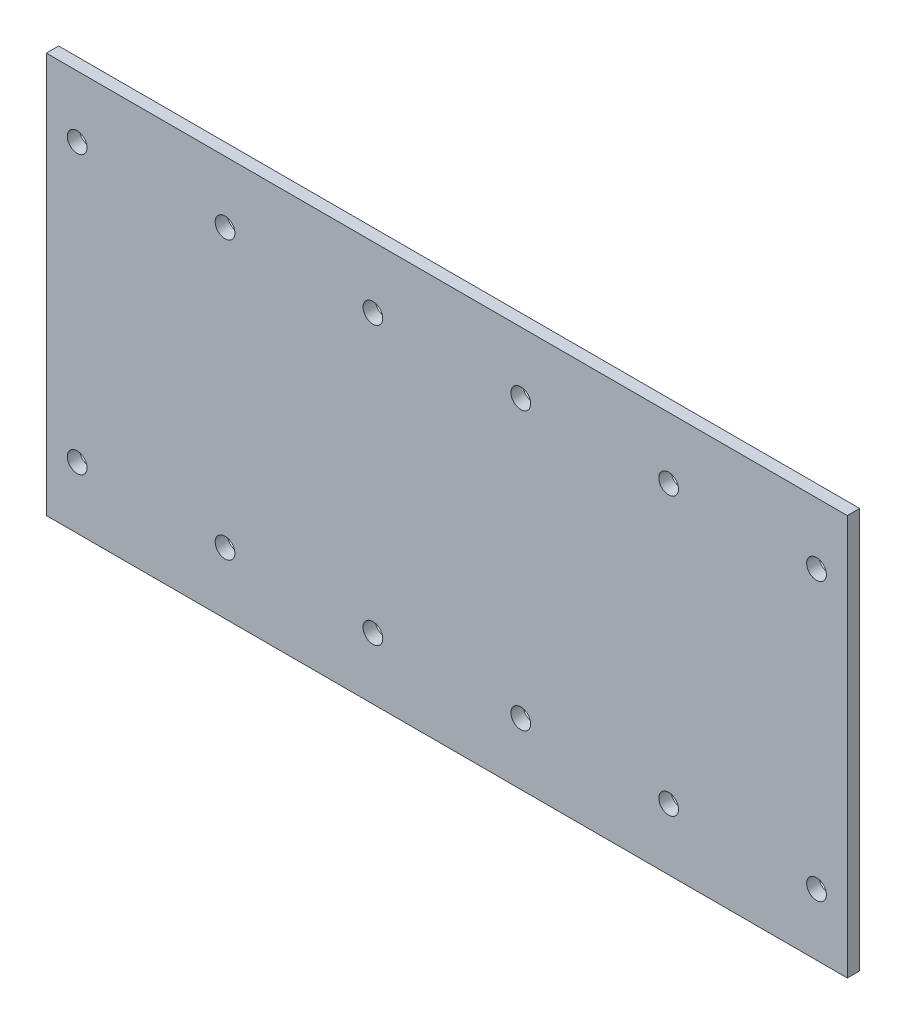
ISO-10303-21;
HEADER;
FILE_DESCRIPTION(('STEP AP214'),'2;1');
FILE_NAME('part.step','',(''),(''),'','','');
FILE_SCHEMA(('AUTOMOTIVE_DESIGN { 1 0 10303 214 1 1 1 1 }'));
ENDSEC;
DATA;
#1=APPLICATION_CONTEXT('core data for automotive mechanical design processes');
#2=APPLICATION_PROTOCOL_DEFINITION('international standard','automotive_design',2000,#1);
#3=PRODUCT_CONTEXT('',#1,'mechanical');
#4=PRODUCT('Part','Part','',(#3));
#5=PRODUCT_RELATED_PRODUCT_CATEGORY('part','',(#4));
#6=PRODUCT_DEFINITION_FORMATION('','',#4);
#7=PRODUCT_DEFINITION_CONTEXT('part definition',#1,'design');
#8=PRODUCT_DEFINITION('design','',#6,#7);
#9=PRODUCT_DEFINITION_SHAPE('','',#8);
#10=(LENGTH_UNIT() NAMED_UNIT(*) SI_UNIT(.MILLI.,.METRE.));
#11=(NAMED_UNIT(*) PLANE_ANGLE_UNIT() SI_UNIT($,.RADIAN.));
#12=(NAMED_UNIT(*) SI_UNIT($,.STERADIAN.) SOLID_ANGLE_UNIT());
#13=UNCERTAINTY_MEASURE_WITH_UNIT(LENGTH_MEASURE(1.E-05),#10,'distance_accuracy_value','');
#14=(GEOMETRIC_REPRESENTATION_CONTEXT(3) GLOBAL_UNCERTAINTY_ASSIGNED_CONTEXT((#13)) GLOBAL_UNIT_ASSIGNED_CONTEXT((#10,
#11,#12)) REPRESENTATION_CONTEXT('',''));
#15=CARTESIAN_POINT('',(0.,0.,0.));
#16=DIRECTION('',(0.,0.,1.));
#17=DIRECTION('',(1.,0.,0.));
#18=AXIS2_PLACEMENT_3D('',#15,#16,#17);
#19=CARTESIAN_POINT('',(0.,0.,2.));
#20=DIRECTION('',(0.,0.,-1.));
#21=DIRECTION('',(-1.,0.,0.));
#22=AXIS2_PLACEMENT_3D('',#19,#20,#21);
#23=PLANE('',#22);
#24=DIRECTION('',(0.,-1.,0.));
#25=VECTOR('',#24,1.);
#26=CARTESIAN_POINT('',(0.,0.,2.));
#27=LINE('',#26,#25);
#28=CARTESIAN_POINT('',(0.,65.,2.));
#29=VERTEX_POINT('',#28);
#30=CARTESIAN_POINT('',(0.,0.,2.));
#31=VERTEX_POINT('',#30);
#32=EDGE_CURVE('E89',#29,#31,#27,.T.);
#33=ORIENTED_EDGE('',*,*,#32,.T.);
#34=DIRECTION('',(1.,0.,0.));
#35=VECTOR('',#34,1.);
#36=CARTESIAN_POINT('',(0.,0.,2.));
#37=LINE('',#36,#35);
#38=CARTESIAN_POINT('',(130.,0.,2.));
#39=VERTEX_POINT('',#38);
#40=EDGE_CURVE('E84',#31,#39,#37,.T.);
#41=ORIENTED_EDGE('',*,*,#40,.T.);
#42=DIRECTION('',(0.,1.,0.));
#43=VECTOR('',#42,1.);
#44=CARTESIAN_POINT('',(130.,0.,2.));
#45=LINE('',#44,#43);
#46=CARTESIAN_POINT('',(130.,65.,2.));
#47=VERTEX_POINT('',#46);
#48=EDGE_CURVE('E87',#39,#47,#45,.T.);
#49=ORIENTED_EDGE('',*,*,#48,.T.);
#50=DIRECTION('',(-1.,0.,0.));
#51=VECTOR('',#50,1.);
#52=CARTESIAN_POINT('',(0.,65.,2.));
#53=LINE('',#52,#51);
#54=EDGE_CURVE('E54',#47,#29,#53,.T.);
#55=ORIENTED_EDGE('',*,*,#54,.T.);
#56=EDGE_LOOP('',(#33,#41,#49,#55));
#57=FACE_BOUND('',#56,.T.);
#58=CARTESIAN_POINT('',(125.,55.,2.));
#59=DIRECTION('',(0.,0.,1.));
#60=DIRECTION('',(1.,0.,0.));
#61=AXIS2_PLACEMENT_3D('',#58,#59,#60);
#62=CIRCLE('',#61,1.60000000000002);
#63=CARTESIAN_POINT('',(126.6,55.,2.));
#64=VERTEX_POINT('',#63);
#65=EDGE_CURVE('E104',#64,#64,#62,.T.);
#66=ORIENTED_EDGE('',*,*,#65,.F.);
#67=EDGE_LOOP('',(#66));
#68=FACE_BOUND('',#67,.T.);
#69=CARTESIAN_POINT('',(101.,55.,2.));
#70=DIRECTION('',(0.,0.,1.));
#71=DIRECTION('',(1.,0.,0.));
#72=AXIS2_PLACEMENT_3D('',#69,#70,#71);
#73=CIRCLE('',#72,1.60000000000001);
#74=CARTESIAN_POINT('',(102.6,55.,2.));
#75=VERTEX_POINT('',#74);
#76=EDGE_CURVE('E119',#75,#75,#73,.T.);
#77=ORIENTED_EDGE('',*,*,#76,.F.);
#78=EDGE_LOOP('',(#77));
#79=FACE_BOUND('',#78,.T.);
#80=CARTESIAN_POINT('',(77.,55.,2.));
#81=DIRECTION('',(0.,0.,1.));
#82=DIRECTION('',(1.,0.,0.));
#83=AXIS2_PLACEMENT_3D('',#80,#81,#82);
#84=CIRCLE('',#83,1.60000000000001);
#85=CARTESIAN_POINT('',(78.6,55.,2.));
#86=VERTEX_POINT('',#85);
#87=EDGE_CURVE('E125',#86,#86,#84,.T.);
#88=ORIENTED_EDGE('',*,*,#87,.F.);
#89=EDGE_LOOP('',(#88));
#90=FACE_BOUND('',#89,.T.);
#91=CARTESIAN_POINT('',(53.,55.,2.));
#92=DIRECTION('',(0.,0.,1.));
#93=DIRECTION('',(1.,0.,0.));
#94=AXIS2_PLACEMENT_3D('',#91,#92,#93);
#95=CIRCLE('',#94,1.60000000000001);
#96=CARTESIAN_POINT('',(54.6,55.,2.));
#97=VERTEX_POINT('',#96);
#98=EDGE_CURVE('E131',#97,#97,#95,.T.);
#99=ORIENTED_EDGE('',*,*,#98,.F.);
#100=EDGE_LOOP('',(#99));
#101=FACE_BOUND('',#100,.T.);
#102=CARTESIAN_POINT('',(29.,55.,2.));
#103=DIRECTION('',(0.,0.,1.));
#104=DIRECTION('',(1.,0.,0.));
#105=AXIS2_PLACEMENT_3D('',#102,#103,#104);
#106=CIRCLE('',#105,1.6);
#107=CARTESIAN_POINT('',(30.6,55.,2.));
#108=VERTEX_POINT('',#107);
#109=EDGE_CURVE('E137',#108,#108,#106,.T.);
#110=ORIENTED_EDGE('',*,*,#109,.F.);
#111=EDGE_LOOP('',(#110));
#112=FACE_BOUND('',#111,.T.);
#113=CARTESIAN_POINT('',(29.,10.,2.));
#114=DIRECTION('',(0.,0.,1.));
#115=DIRECTION('',(1.,0.,0.));
#116=AXIS2_PLACEMENT_3D('',#113,#114,#115);
#117=CIRCLE('',#116,1.6);
#118=CARTESIAN_POINT('',(30.6,10.,2.));
#119=VERTEX_POINT('',#118);
#120=EDGE_CURVE('E143',#119,#119,#117,.T.);
#121=ORIENTED_EDGE('',*,*,#120,.F.);
#122=EDGE_LOOP('',(#121));
#123=FACE_BOUND('',#122,.T.);
#124=CARTESIAN_POINT('',(53.,10.,2.));
#125=DIRECTION('',(0.,0.,1.));
#126=DIRECTION('',(1.,0.,0.));
#127=AXIS2_PLACEMENT_3D('',#124,#125,#126);
#128=CIRCLE('',#127,1.6);
#129=CARTESIAN_POINT('',(54.6,10.,2.));
#130=VERTEX_POINT('',#129);
#131=EDGE_CURVE('E149',#130,#130,#128,.T.);
#132=ORIENTED_EDGE('',*,*,#131,.F.);
#133=EDGE_LOOP('',(#132));
#134=FACE_BOUND('',#133,.T.);
#135=CARTESIAN_POINT('',(77.,10.,2.));
#136=DIRECTION('',(0.,0.,1.));
#137=DIRECTION('',(1.,0.,0.));
#138=AXIS2_PLACEMENT_3D('',#135,#136,#137);
#139=CIRCLE('',#138,1.6);
#140=CARTESIAN_POINT('',(78.6,10.,2.));
#141=VERTEX_POINT('',#140);
#142=EDGE_CURVE('E155',#141,#141,#139,.T.);
#143=ORIENTED_EDGE('',*,*,#142,.F.);
#144=EDGE_LOOP('',(#143));
#145=FACE_BOUND('',#144,.T.);
#146=CARTESIAN_POINT('',(101.,10.,2.));
#147=DIRECTION('',(0.,0.,1.));
#148=DIRECTION('',(1.,0.,0.));
#149=AXIS2_PLACEMENT_3D('',#146,#147,#148);
#150=CIRCLE('',#149,1.6);
#151=CARTESIAN_POINT('',(102.6,10.,2.));
#152=VERTEX_POINT('',#151);
#153=EDGE_CURVE('E161',#152,#152,#150,.T.);
#154=ORIENTED_EDGE('',*,*,#153,.F.);
#155=EDGE_LOOP('',(#154));
#156=FACE_BOUND('',#155,.T.);
#157=CARTESIAN_POINT('',(125.,10.,2.));
#158=DIRECTION('',(0.,0.,1.));
#159=DIRECTION('',(1.,0.,0.));
#160=AXIS2_PLACEMENT_3D('',#157,#158,#159);
#161=CIRCLE('',#160,1.60000000000002);
#162=CARTESIAN_POINT('',(126.6,10.,2.));
#163=VERTEX_POINT('',#162);
#164=EDGE_CURVE('E167',#163,#163,#161,.T.);
#165=ORIENTED_EDGE('',*,*,#164,.F.);
#166=EDGE_LOOP('',(#165));
#167=FACE_BOUND('',#166,.T.);
#168=CARTESIAN_POINT('',(5.00000000000001,10.,2.));
#169=DIRECTION('',(0.,0.,1.));
#170=DIRECTION('',(1.,0.,0.));
#171=AXIS2_PLACEMENT_3D('',#168,#169,#170);
#172=CIRCLE('',#171,1.6);
#173=CARTESIAN_POINT('',(6.60000000000001,10.,2.));
#174=VERTEX_POINT('',#173);
#175=EDGE_CURVE('E173',#174,#174,#172,.T.);
#176=ORIENTED_EDGE('',*,*,#175,.F.);
#177=EDGE_LOOP('',(#176));
#178=FACE_BOUND('',#177,.T.);
#179=CARTESIAN_POINT('',(5.00000000000001,55.,2.));
#180=DIRECTION('',(0.,0.,1.));
#181=DIRECTION('',(1.,0.,0.));
#182=AXIS2_PLACEMENT_3D('',#179,#180,#181);
#183=CIRCLE('',#182,1.6);
#184=CARTESIAN_POINT('',(6.60000000000001,55.,2.));
#185=VERTEX_POINT('',#184);
#186=EDGE_CURVE('E179',#185,#185,#183,.T.);
#187=ORIENTED_EDGE('',*,*,#186,.F.);
#188=EDGE_LOOP('',(#187));
#189=FACE_BOUND('',#188,.T.);
#190=ADVANCED_FACE('F37',(#57,#68,#79,#90,#101,#112,#123,#134,#145,#156,#167,#178,#189),#23,.F.);
#191=CARTESIAN_POINT('',(0.,0.,0.));
#192=DIRECTION('',(0.,0.,-1.));
#193=DIRECTION('',(-1.,0.,0.));
#194=AXIS2_PLACEMENT_3D('',#191,#192,#193);
#195=PLANE('',#194);
#196=CARTESIAN_POINT('',(5.00000000000001,10.,0.));
#197=DIRECTION('',(0.,0.,1.));
#198=DIRECTION('',(1.,0.,0.));
#199=AXIS2_PLACEMENT_3D('',#196,#197,#198);
#200=CIRCLE('',#199,1.6);
#201=CARTESIAN_POINT('',(6.60000000000001,10.,0.));
#202=VERTEX_POINT('',#201);
#203=EDGE_CURVE('E176',#202,#202,#200,.T.);
#204=ORIENTED_EDGE('',*,*,#203,.T.);
#205=EDGE_LOOP('',(#204));
#206=FACE_BOUND('',#205,.T.);
#207=CARTESIAN_POINT('',(101.,10.,0.));
#208=DIRECTION('',(0.,0.,1.));
#209=DIRECTION('',(1.,0.,0.));
#210=AXIS2_PLACEMENT_3D('',#207,#208,#209);
#211=CIRCLE('',#210,1.6);
#212=CARTESIAN_POINT('',(102.6,10.,0.));
#213=VERTEX_POINT('',#212);
#214=EDGE_CURVE('E164',#213,#213,#211,.T.);
#215=ORIENTED_EDGE('',*,*,#214,.T.);
#216=EDGE_LOOP('',(#215));
#217=FACE_BOUND('',#216,.T.);
#218=CARTESIAN_POINT('',(53.,10.,0.));
#219=DIRECTION('',(0.,0.,1.));
#220=DIRECTION('',(1.,0.,0.));
#221=AXIS2_PLACEMENT_3D('',#218,#219,#220);
#222=CIRCLE('',#221,1.6);
#223=CARTESIAN_POINT('',(54.6,10.,0.));
#224=VERTEX_POINT('',#223);
#225=EDGE_CURVE('E152',#224,#224,#222,.T.);
#226=ORIENTED_EDGE('',*,*,#225,.T.);
#227=EDGE_LOOP('',(#226));
#228=FACE_BOUND('',#227,.T.);
#229=CARTESIAN_POINT('',(29.,55.,0.));
#230=DIRECTION('',(0.,0.,1.));
#231=DIRECTION('',(1.,0.,0.));
#232=AXIS2_PLACEMENT_3D('',#229,#230,#231);
#233=CIRCLE('',#232,1.6);
#234=CARTESIAN_POINT('',(30.6,55.,0.));
#235=VERTEX_POINT('',#234);
#236=EDGE_CURVE('E140',#235,#235,#233,.T.);
#237=ORIENTED_EDGE('',*,*,#236,.T.);
#238=EDGE_LOOP('',(#237));
#239=FACE_BOUND('',#238,.T.);
#240=CARTESIAN_POINT('',(77.,55.,0.));
#241=DIRECTION('',(0.,0.,1.));
#242=DIRECTION('',(1.,0.,0.));
#243=AXIS2_PLACEMENT_3D('',#240,#241,#242);
#244=CIRCLE('',#243,1.60000000000001);
#245=CARTESIAN_POINT('',(78.6,55.,0.));
#246=VERTEX_POINT('',#245);
#247=EDGE_CURVE('E128',#246,#246,#244,.T.);
#248=ORIENTED_EDGE('',*,*,#247,.T.);
#249=EDGE_LOOP('',(#248));
#250=FACE_BOUND('',#249,.T.);
#251=CARTESIAN_POINT('',(125.,55.,0.));
#252=DIRECTION('',(0.,0.,1.));
#253=DIRECTION('',(1.,0.,0.));
#254=AXIS2_PLACEMENT_3D('',#251,#252,#253);
#255=CIRCLE('',#254,1.60000000000002);
#256=CARTESIAN_POINT('',(126.6,55.,0.));
#257=VERTEX_POINT('',#256);
#258=EDGE_CURVE('E116',#257,#257,#255,.T.);
#259=ORIENTED_EDGE('',*,*,#258,.T.);
#260=EDGE_LOOP('',(#259));
#261=FACE_BOUND('',#260,.T.);
#262=DIRECTION('',(0.,-1.,0.));
#263=VECTOR('',#262,1.);
#264=CARTESIAN_POINT('',(0.,0.,0.));
#265=LINE('',#264,#263);
#266=CARTESIAN_POINT('',(0.,65.,0.));
#267=VERTEX_POINT('',#266);
#268=CARTESIAN_POINT('',(0.,0.,0.));
#269=VERTEX_POINT('',#268);
#270=EDGE_CURVE('E101',#267,#269,#265,.T.);
#271=ORIENTED_EDGE('',*,*,#270,.F.);
#272=DIRECTION('',(-1.,0.,0.));
#273=VECTOR('',#272,1.);
#274=CARTESIAN_POINT('',(0.,65.,0.));
#275=LINE('',#274,#273);
#276=CARTESIAN_POINT('',(130.,65.,0.));
#277=VERTEX_POINT('',#276);
#278=EDGE_CURVE('E77',#277,#267,#275,.T.);
#279=ORIENTED_EDGE('',*,*,#278,.F.);
#280=DIRECTION('',(0.,1.,0.));
#281=VECTOR('',#280,1.);
#282=CARTESIAN_POINT('',(130.,0.,0.));
#283=LINE('',#282,#281);
#284=CARTESIAN_POINT('',(130.,0.,0.));
#285=VERTEX_POINT('',#284);
#286=EDGE_CURVE('E71',#285,#277,#283,.T.);
#287=ORIENTED_EDGE('',*,*,#286,.F.);
#288=DIRECTION('',(1.,0.,0.));
#289=VECTOR('',#288,1.);
#290=CARTESIAN_POINT('',(0.,0.,0.));
#291=LINE('',#290,#289);
#292=EDGE_CURVE('E93',#269,#285,#291,.T.);
#293=ORIENTED_EDGE('',*,*,#292,.F.);
#294=EDGE_LOOP('',(#271,#279,#287,#293));
#295=FACE_BOUND('',#294,.T.);
#296=CARTESIAN_POINT('',(101.,55.,0.));
#297=DIRECTION('',(0.,0.,1.));
#298=DIRECTION('',(1.,0.,0.));
#299=AXIS2_PLACEMENT_3D('',#296,#297,#298);
#300=CIRCLE('',#299,1.60000000000001);
#301=CARTESIAN_POINT('',(102.6,55.,0.));
#302=VERTEX_POINT('',#301);
#303=EDGE_CURVE('E122',#302,#302,#300,.T.);
#304=ORIENTED_EDGE('',*,*,#303,.T.);
#305=EDGE_LOOP('',(#304));
#306=FACE_BOUND('',#305,.T.);
#307=CARTESIAN_POINT('',(53.,55.,0.));
#308=DIRECTION('',(0.,0.,1.));
#309=DIRECTION('',(1.,0.,0.));
#310=AXIS2_PLACEMENT_3D('',#307,#308,#309);
#311=CIRCLE('',#310,1.60000000000001);
#312=CARTESIAN_POINT('',(54.6,55.,0.));
#313=VERTEX_POINT('',#312);
#314=EDGE_CURVE('E134',#313,#313,#311,.T.);
#315=ORIENTED_EDGE('',*,*,#314,.T.);
#316=EDGE_LOOP('',(#315));
#317=FACE_BOUND('',#316,.T.);
#318=CARTESIAN_POINT('',(29.,10.,0.));
#319=DIRECTION('',(0.,0.,1.));
#320=DIRECTION('',(1.,0.,0.));
#321=AXIS2_PLACEMENT_3D('',#318,#319,#320);
#322=CIRCLE('',#321,1.6);
#323=CARTESIAN_POINT('',(30.6,10.,0.));
#324=VERTEX_POINT('',#323);
#325=EDGE_CURVE('E146',#324,#324,#322,.T.);
#326=ORIENTED_EDGE('',*,*,#325,.T.);
#327=EDGE_LOOP('',(#326));
#328=FACE_BOUND('',#327,.T.);
#329=CARTESIAN_POINT('',(77.,10.,0.));
#330=DIRECTION('',(0.,0.,1.));
#331=DIRECTION('',(1.,0.,0.));
#332=AXIS2_PLACEMENT_3D('',#329,#330,#331);
#333=CIRCLE('',#332,1.6);
#334=CARTESIAN_POINT('',(78.6,10.,0.));
#335=VERTEX_POINT('',#334);
#336=EDGE_CURVE('E158',#335,#335,#333,.T.);
#337=ORIENTED_EDGE('',*,*,#336,.T.);
#338=EDGE_LOOP('',(#337));
#339=FACE_BOUND('',#338,.T.);
#340=CARTESIAN_POINT('',(125.,10.,0.));
#341=DIRECTION('',(0.,0.,1.));
#342=DIRECTION('',(1.,0.,0.));
#343=AXIS2_PLACEMENT_3D('',#340,#341,#342);
#344=CIRCLE('',#343,1.60000000000002);
#345=CARTESIAN_POINT('',(126.6,10.,0.));
#346=VERTEX_POINT('',#345);
#347=EDGE_CURVE('E170',#346,#346,#344,.T.);
#348=ORIENTED_EDGE('',*,*,#347,.T.);
#349=EDGE_LOOP('',(#348));
#350=FACE_BOUND('',#349,.T.);
#351=CARTESIAN_POINT('',(5.00000000000001,55.,0.));
#352=DIRECTION('',(0.,0.,1.));
#353=DIRECTION('',(1.,0.,0.));
#354=AXIS2_PLACEMENT_3D('',#351,#352,#353);
#355=CIRCLE('',#354,1.6);
#356=CARTESIAN_POINT('',(6.60000000000001,55.,0.));
#357=VERTEX_POINT('',#356);
#358=EDGE_CURVE('E182',#357,#357,#355,.T.);
#359=ORIENTED_EDGE('',*,*,#358,.T.);
#360=EDGE_LOOP('',(#359));
#361=FACE_BOUND('',#360,.T.);
#362=ADVANCED_FACE('F112',(#206,#217,#228,#239,#250,#261,#295,#306,#317,#328,#339,#350,#361),
#195,.T.);
#363=CARTESIAN_POINT('',(0.,0.,2.));
#364=DIRECTION('',(1.,0.,0.));
#365=DIRECTION('',(0.,0.,-1.));
#366=AXIS2_PLACEMENT_3D('',#363,#364,#365);
#367=PLANE('',#366);
#368=ORIENTED_EDGE('',*,*,#270,.T.);
#369=DIRECTION('',(0.,0.,-1.));
#370=VECTOR('',#369,1.);
#371=CARTESIAN_POINT('',(0.,0.,2.));
#372=LINE('',#371,#370);
#373=EDGE_CURVE('E11',#31,#269,#372,.T.);
#374=ORIENTED_EDGE('',*,*,#373,.F.);
#375=ORIENTED_EDGE('',*,*,#32,.F.);
#376=DIRECTION('',(0.,0.,-1.));
#377=VECTOR('',#376,1.);
#378=CARTESIAN_POINT('',(0.,65.,2.));
#379=LINE('',#378,#377);
#380=EDGE_CURVE('E97',#29,#267,#379,.T.);
#381=ORIENTED_EDGE('',*,*,#380,.T.);
#382=EDGE_LOOP('',(#368,#374,#375,#381));
#383=FACE_BOUND('',#382,.T.);
#384=ADVANCED_FACE('F39',(#383),#367,.F.);
#385=CARTESIAN_POINT('',(0.,0.,2.));
#386=DIRECTION('',(0.,1.,0.));
#387=DIRECTION('',(0.,0.,1.));
#388=AXIS2_PLACEMENT_3D('',#385,#386,#387);
#389=PLANE('',#388);
#390=ORIENTED_EDGE('',*,*,#292,.T.);
#391=DIRECTION('',(0.,0.,-1.));
#392=VECTOR('',#391,1.);
#393=CARTESIAN_POINT('',(130.,0.,2.));
#394=LINE('',#393,#392);
#395=EDGE_CURVE('E46',#39,#285,#394,.T.);
#396=ORIENTED_EDGE('',*,*,#395,.F.);
#397=ORIENTED_EDGE('',*,*,#40,.F.);
#398=ORIENTED_EDGE('',*,*,#373,.T.);
#399=EDGE_LOOP('',(#390,#396,#397,#398));
#400=FACE_BOUND('',#399,.T.);
#401=ADVANCED_FACE('F92',(#400),#389,.F.);
#402=CARTESIAN_POINT('',(130.,0.,2.));
#403=DIRECTION('',(-1.,0.,0.));
#404=DIRECTION('',(0.,0.,1.));
#405=AXIS2_PLACEMENT_3D('',#402,#403,#404);
#406=PLANE('',#405);
#407=ORIENTED_EDGE('',*,*,#286,.T.);
#408=DIRECTION('',(0.,0.,-1.));
#409=VECTOR('',#408,1.);
#410=CARTESIAN_POINT('',(130.,65.,2.));
#411=LINE('',#410,#409);
#412=EDGE_CURVE('E94',#47,#277,#411,.T.);
#413=ORIENTED_EDGE('',*,*,#412,.F.);
#414=ORIENTED_EDGE('',*,*,#48,.F.);
#415=ORIENTED_EDGE('',*,*,#395,.T.);
#416=EDGE_LOOP('',(#407,#413,#414,#415));
#417=FACE_BOUND('',#416,.T.);
#418=ADVANCED_FACE('F95',(#417),#406,.F.);
#419=CARTESIAN_POINT('',(0.,65.,2.));
#420=DIRECTION('',(0.,-1.,0.));
#421=DIRECTION('',(0.,0.,-1.));
#422=AXIS2_PLACEMENT_3D('',#419,#420,#421);
#423=PLANE('',#422);
#424=ORIENTED_EDGE('',*,*,#278,.T.);
#425=ORIENTED_EDGE('',*,*,#380,.F.);
#426=ORIENTED_EDGE('',*,*,#54,.F.);
#427=ORIENTED_EDGE('',*,*,#412,.T.);
#428=EDGE_LOOP('',(#424,#425,#426,#427));
#429=FACE_BOUND('',#428,.T.);
#430=ADVANCED_FACE('F109',(#429),#423,.F.);
#431=CARTESIAN_POINT('',(125.,55.,2.));
#432=DIRECTION('',(0.,0.,-1.));
#433=DIRECTION('',(-1.,0.,0.));
#434=AXIS2_PLACEMENT_3D('',#431,#432,#433);
#435=CYLINDRICAL_SURFACE('',#434,1.60000000000002);
#436=ORIENTED_EDGE('',*,*,#65,.T.);
#437=EDGE_LOOP('',(#436));
#438=FACE_BOUND('',#437,.T.);
#439=ORIENTED_EDGE('',*,*,#258,.F.);
#440=EDGE_LOOP('',(#439));
#441=FACE_BOUND('',#440,.T.);
#442=ADVANCED_FACE('F199',(#438,#441),#435,.F.);
#443=CARTESIAN_POINT('',(101.,55.,2.));
#444=DIRECTION('',(0.,0.,-1.));
#445=DIRECTION('',(-1.,0.,0.));
#446=AXIS2_PLACEMENT_3D('',#443,#444,#445);
#447=CYLINDRICAL_SURFACE('',#446,1.60000000000001);
#448=ORIENTED_EDGE('',*,*,#76,.T.);
#449=EDGE_LOOP('',(#448));
#450=FACE_BOUND('',#449,.T.);
#451=ORIENTED_EDGE('',*,*,#303,.F.);
#452=EDGE_LOOP('',(#451));
#453=FACE_BOUND('',#452,.T.);
#454=ADVANCED_FACE('F245',(#450,#453),#447,.F.);
#455=CARTESIAN_POINT('',(77.,55.,2.));
#456=DIRECTION('',(0.,0.,-1.));
#457=DIRECTION('',(-1.,0.,0.));
#458=AXIS2_PLACEMENT_3D('',#455,#456,#457);
#459=CYLINDRICAL_SURFACE('',#458,1.60000000000001);
#460=ORIENTED_EDGE('',*,*,#87,.T.);
#461=EDGE_LOOP('',(#460));
#462=FACE_BOUND('',#461,.T.);
#463=ORIENTED_EDGE('',*,*,#247,.F.);
#464=EDGE_LOOP('',(#463));
#465=FACE_BOUND('',#464,.T.);
#466=ADVANCED_FACE('F253',(#462,#465),#459,.F.);
#467=CARTESIAN_POINT('',(53.,55.,2.));
#468=DIRECTION('',(0.,0.,-1.));
#469=DIRECTION('',(-1.,0.,0.));
#470=AXIS2_PLACEMENT_3D('',#467,#468,#469);
#471=CYLINDRICAL_SURFACE('',#470,1.60000000000001);
#472=ORIENTED_EDGE('',*,*,#98,.T.);
#473=EDGE_LOOP('',(#472));
#474=FACE_BOUND('',#473,.T.);
#475=ORIENTED_EDGE('',*,*,#314,.F.);
#476=EDGE_LOOP('',(#475));
#477=FACE_BOUND('',#476,.T.);
#478=ADVANCED_FACE('F261',(#474,#477),#471,.F.);
#479=CARTESIAN_POINT('',(29.,55.,2.));
#480=DIRECTION('',(0.,0.,-1.));
#481=DIRECTION('',(-1.,0.,0.));
#482=AXIS2_PLACEMENT_3D('',#479,#480,#481);
#483=CYLINDRICAL_SURFACE('',#482,1.6);
#484=ORIENTED_EDGE('',*,*,#109,.T.);
#485=EDGE_LOOP('',(#484));
#486=FACE_BOUND('',#485,.T.);
#487=ORIENTED_EDGE('',*,*,#236,.F.);
#488=EDGE_LOOP('',(#487));
#489=FACE_BOUND('',#488,.T.);
#490=ADVANCED_FACE('F270',(#486,#489),#483,.F.);
#491=CARTESIAN_POINT('',(29.,10.,2.));
#492=DIRECTION('',(0.,0.,-1.));
#493=DIRECTION('',(-1.,0.,0.));
#494=AXIS2_PLACEMENT_3D('',#491,#492,#493);
#495=CYLINDRICAL_SURFACE('',#494,1.6);
#496=ORIENTED_EDGE('',*,*,#120,.T.);
#497=EDGE_LOOP('',(#496));
#498=FACE_BOUND('',#497,.T.);
#499=ORIENTED_EDGE('',*,*,#325,.F.);
#500=EDGE_LOOP('',(#499));
#501=FACE_BOUND('',#500,.T.);
#502=ADVANCED_FACE('F279',(#498,#501),#495,.F.);
#503=CARTESIAN_POINT('',(53.,10.,2.));
#504=DIRECTION('',(0.,0.,-1.));
#505=DIRECTION('',(-1.,0.,0.));
#506=AXIS2_PLACEMENT_3D('',#503,#504,#505);
#507=CYLINDRICAL_SURFACE('',#506,1.6);
#508=ORIENTED_EDGE('',*,*,#131,.T.);
#509=EDGE_LOOP('',(#508));
#510=FACE_BOUND('',#509,.T.);
#511=ORIENTED_EDGE('',*,*,#225,.F.);
#512=EDGE_LOOP('',(#511));
#513=FACE_BOUND('',#512,.T.);
#514=ADVANCED_FACE('F288',(#510,#513),#507,.F.);
#515=CARTESIAN_POINT('',(77.,10.,2.));
#516=DIRECTION('',(0.,0.,-1.));
#517=DIRECTION('',(-1.,0.,0.));
#518=AXIS2_PLACEMENT_3D('',#515,#516,#517);
#519=CYLINDRICAL_SURFACE('',#518,1.6);
#520=ORIENTED_EDGE('',*,*,#142,.T.);
#521=EDGE_LOOP('',(#520));
#522=FACE_BOUND('',#521,.T.);
#523=ORIENTED_EDGE('',*,*,#336,.F.);
#524=EDGE_LOOP('',(#523));
#525=FACE_BOUND('',#524,.T.);
#526=ADVANCED_FACE('F297',(#522,#525),#519,.F.);
#527=CARTESIAN_POINT('',(101.,10.,2.));
#528=DIRECTION('',(0.,0.,-1.));
#529=DIRECTION('',(-1.,0.,0.));
#530=AXIS2_PLACEMENT_3D('',#527,#528,#529);
#531=CYLINDRICAL_SURFACE('',#530,1.6);
#532=ORIENTED_EDGE('',*,*,#153,.T.);
#533=EDGE_LOOP('',(#532));
#534=FACE_BOUND('',#533,.T.);
#535=ORIENTED_EDGE('',*,*,#214,.F.);
#536=EDGE_LOOP('',(#535));
#537=FACE_BOUND('',#536,.T.);
#538=ADVANCED_FACE('F306',(#534,#537),#531,.F.);
#539=CARTESIAN_POINT('',(125.,10.,2.));
#540=DIRECTION('',(0.,0.,-1.));
#541=DIRECTION('',(-1.,0.,0.));
#542=AXIS2_PLACEMENT_3D('',#539,#540,#541);
#543=CYLINDRICAL_SURFACE('',#542,1.60000000000002);
#544=ORIENTED_EDGE('',*,*,#164,.T.);
#545=EDGE_LOOP('',(#544));
#546=FACE_BOUND('',#545,.T.);
#547=ORIENTED_EDGE('',*,*,#347,.F.);
#548=EDGE_LOOP('',(#547));
#549=FACE_BOUND('',#548,.T.);
#550=ADVANCED_FACE('F315',(#546,#549),#543,.F.);
#551=CARTESIAN_POINT('',(5.00000000000001,10.,2.));
#552=DIRECTION('',(0.,0.,-1.));
#553=DIRECTION('',(-1.,0.,0.));
#554=AXIS2_PLACEMENT_3D('',#551,#552,#553);
#555=CYLINDRICAL_SURFACE('',#554,1.6);
#556=ORIENTED_EDGE('',*,*,#175,.T.);
#557=EDGE_LOOP('',(#556));
#558=FACE_BOUND('',#557,.T.);
#559=ORIENTED_EDGE('',*,*,#203,.F.);
#560=EDGE_LOOP('',(#559));
#561=FACE_BOUND('',#560,.T.);
#562=ADVANCED_FACE('F324',(#558,#561),#555,.F.);
#563=CARTESIAN_POINT('',(5.00000000000001,55.,2.));
#564=DIRECTION('',(0.,0.,-1.));
#565=DIRECTION('',(-1.,0.,0.));
#566=AXIS2_PLACEMENT_3D('',#563,#564,#565);
#567=CYLINDRICAL_SURFACE('',#566,1.6);
#568=ORIENTED_EDGE('',*,*,#186,.T.);
#569=EDGE_LOOP('',(#568));
#570=FACE_BOUND('',#569,.T.);
#571=ORIENTED_EDGE('',*,*,#358,.F.);
#572=EDGE_LOOP('',(#571));
#573=FACE_BOUND('',#572,.T.);
#574=ADVANCED_FACE('F188',(#570,#573),#567,.F.);
#575=CLOSED_SHELL('',(#190,#362,#384,#401,#418,#430,#442,#454,#466,#478,#490,#502,#514,#526,
#538,#550,#562,#574));
#576=MANIFOLD_SOLID_BREP('B2',#575);
#577=ADVANCED_BREP_SHAPE_REPRESENTATION('',(#18,#576),#14);
#578=SHAPE_DEFINITION_REPRESENTATION(#9,#577);
ENDSEC;
END-ISO-10303-21;
